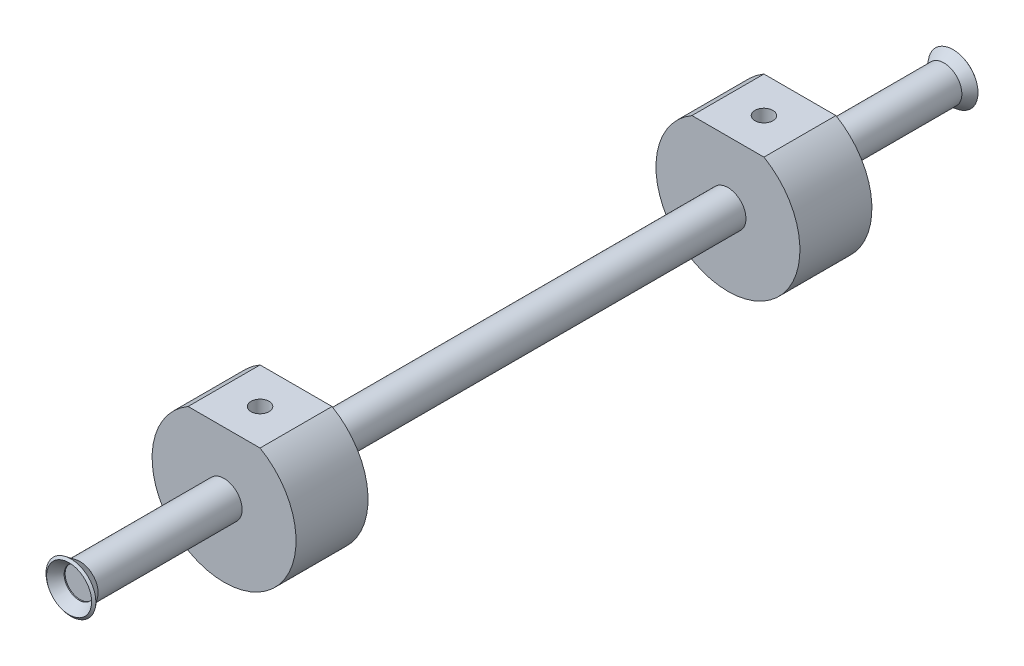
ISO-10303-21;
HEADER;
FILE_DESCRIPTION(('STEP AP214'),'2;1');
FILE_NAME('part.step','',(''),(''),'','','');
FILE_SCHEMA(('AUTOMOTIVE_DESIGN { 1 0 10303 214 1 1 1 1 }'));
ENDSEC;
DATA;
#1=APPLICATION_CONTEXT('core data for automotive mechanical design processes');
#2=APPLICATION_PROTOCOL_DEFINITION('international standard','automotive_design',2000,#1);
#3=PRODUCT_CONTEXT('',#1,'mechanical');
#4=PRODUCT('Part','Part','',(#3));
#5=PRODUCT_RELATED_PRODUCT_CATEGORY('part','',(#4));
#6=PRODUCT_DEFINITION_FORMATION('','',#4);
#7=PRODUCT_DEFINITION_CONTEXT('part definition',#1,'design');
#8=PRODUCT_DEFINITION('design','',#6,#7);
#9=PRODUCT_DEFINITION_SHAPE('','',#8);
#10=(LENGTH_UNIT() NAMED_UNIT(*) SI_UNIT(.MILLI.,.METRE.));
#11=(NAMED_UNIT(*) PLANE_ANGLE_UNIT() SI_UNIT($,.RADIAN.));
#12=(NAMED_UNIT(*) SI_UNIT($,.STERADIAN.) SOLID_ANGLE_UNIT());
#13=UNCERTAINTY_MEASURE_WITH_UNIT(LENGTH_MEASURE(1.E-05),#10,'distance_accuracy_value','');
#14=(GEOMETRIC_REPRESENTATION_CONTEXT(3) GLOBAL_UNCERTAINTY_ASSIGNED_CONTEXT((#13)) GLOBAL_UNIT_ASSIGNED_CONTEXT((#10,
#11,#12)) REPRESENTATION_CONTEXT('',''));
#15=CARTESIAN_POINT('',(0.,0.,0.));
#16=DIRECTION('',(0.,0.,1.));
#17=DIRECTION('',(1.,0.,0.));
#18=AXIS2_PLACEMENT_3D('',#15,#16,#17);
#19=CARTESIAN_POINT('',(0.,5.28320000000011,152.4));
#20=DIRECTION('',(0.,0.,1.));
#21=DIRECTION('',(0.,-1.,0.));
#22=AXIS2_PLACEMENT_3D('',#19,#20,#21);
#23=PLANE('',#22);
#24=CARTESIAN_POINT('',(0.,0.,152.4));
#25=DIRECTION('',(0.,0.,1.));
#26=DIRECTION('',(0.,-1.,0.));
#27=AXIS2_PLACEMENT_3D('',#24,#25,#26);
#28=CIRCLE('',#27,6.35);
#29=CARTESIAN_POINT('',(0.,-6.35000000000001,152.4));
#30=VERTEX_POINT('',#29);
#31=EDGE_CURVE('E70',#30,#30,#28,.T.);
#32=ORIENTED_EDGE('',*,*,#31,.F.);
#33=EDGE_LOOP('',(#32));
#34=FACE_BOUND('',#33,.T.);
#35=CARTESIAN_POINT('',(0.,0.,152.4));
#36=DIRECTION('',(0.,0.,1.));
#37=DIRECTION('',(0.,-1.,0.));
#38=AXIS2_PLACEMENT_3D('',#35,#36,#37);
#39=CIRCLE('',#38,5.2832);
#40=CARTESIAN_POINT('',(0.,-5.28320000000001,152.4));
#41=VERTEX_POINT('',#40);
#42=EDGE_CURVE('E12',#41,#41,#39,.T.);
#43=ORIENTED_EDGE('',*,*,#42,.T.);
#44=EDGE_LOOP('',(#43));
#45=FACE_BOUND('',#44,.T.);
#46=ADVANCED_FACE('F51',(#34,#45),#23,.F.);
#47=CARTESIAN_POINT('',(0.,0.,152.4));
#48=DIRECTION('',(0.,0.,1.));
#49=DIRECTION('',(0.,-1.,0.));
#50=AXIS2_PLACEMENT_3D('',#47,#48,#49);
#51=CYLINDRICAL_SURFACE('',#50,5.2832);
#52=ORIENTED_EDGE('',*,*,#42,.F.);
#53=EDGE_LOOP('',(#52));
#54=FACE_BOUND('',#53,.T.);
#55=CARTESIAN_POINT('',(0.,0.,152.756946286845));
#56=DIRECTION('',(0.,0.,1.));
#57=DIRECTION('',(0.,-1.,0.));
#58=AXIS2_PLACEMENT_3D('',#55,#56,#57);
#59=CIRCLE('',#58,5.2832);
#60=CARTESIAN_POINT('',(0.,-5.28320000000006,152.756946286845));
#61=VERTEX_POINT('',#60);
#62=EDGE_CURVE('E57',#61,#61,#59,.T.);
#63=ORIENTED_EDGE('',*,*,#62,.T.);
#64=EDGE_LOOP('',(#63));
#65=FACE_BOUND('',#64,.T.);
#66=ADVANCED_FACE('F77',(#54,#65),#51,.F.);
#67=CARTESIAN_POINT('',(0.,0.,156.287670979531));
#68=DIRECTION('',(0.,0.,1.));
#69=DIRECTION('',(0.,-1.,0.));
#70=AXIS2_PLACEMENT_3D('',#67,#68,#69);
#71=CONICAL_SURFACE('',#70,7.94379189197148,0.645771823237903);
#72=ORIENTED_EDGE('',*,*,#62,.F.);
#73=EDGE_LOOP('',(#72));
#74=FACE_BOUND('',#73,.T.);
#75=CARTESIAN_POINT('',(0.,0.,156.287670979531));
#76=DIRECTION('',(0.,0.,1.));
#77=DIRECTION('',(0.,-1.,0.));
#78=AXIS2_PLACEMENT_3D('',#75,#76,#77);
#79=CIRCLE('',#78,7.94379189197148);
#80=CARTESIAN_POINT('',(0.,-7.94379189197154,156.287670979531));
#81=VERTEX_POINT('',#80);
#82=EDGE_CURVE('E61',#81,#81,#79,.T.);
#83=ORIENTED_EDGE('',*,*,#82,.T.);
#84=EDGE_LOOP('',(#83));
#85=FACE_BOUND('',#84,.T.);
#86=ADVANCED_FACE('F81',(#74,#85),#71,.F.);
#87=CARTESIAN_POINT('',(0.,0.,155.645654712832));
#88=DIRECTION('',(0.,0.,-1.));
#89=DIRECTION('',(0.,1.,0.));
#90=AXIS2_PLACEMENT_3D('',#87,#88,#89);
#91=CONICAL_SURFACE('',#90,8.79577625408993,0.925024503556994);
#92=ORIENTED_EDGE('',*,*,#82,.F.);
#93=EDGE_LOOP('',(#92));
#94=FACE_BOUND('',#93,.T.);
#95=CARTESIAN_POINT('',(0.,0.,155.645654712832));
#96=DIRECTION('',(0.,0.,1.));
#97=DIRECTION('',(0.,-1.,0.));
#98=AXIS2_PLACEMENT_3D('',#95,#96,#97);
#99=CIRCLE('',#98,8.79577625408993);
#100=CARTESIAN_POINT('',(0.,-8.79577625409,155.645654712832));
#101=VERTEX_POINT('',#100);
#102=EDGE_CURVE('E65',#101,#101,#99,.T.);
#103=ORIENTED_EDGE('',*,*,#102,.T.);
#104=EDGE_LOOP('',(#103));
#105=FACE_BOUND('',#104,.T.);
#106=ADVANCED_FACE('F86',(#94,#105),#91,.T.);
#107=CARTESIAN_POINT('',(0.,0.,152.4));
#108=DIRECTION('',(0.,0.,1.));
#109=DIRECTION('',(0.,-1.,0.));
#110=AXIS2_PLACEMENT_3D('',#107,#108,#109);
#111=CONICAL_SURFACE('',#110,6.35,0.645771823237903);
#112=ORIENTED_EDGE('',*,*,#102,.F.);
#113=EDGE_LOOP('',(#112));
#114=FACE_BOUND('',#113,.T.);
#115=ORIENTED_EDGE('',*,*,#31,.T.);
#116=EDGE_LOOP('',(#115));
#117=FACE_BOUND('',#116,.T.);
#118=ADVANCED_FACE('F74',(#114,#117),#111,.T.);
#119=CLOSED_SHELL('',(#46,#66,#86,#106,#118));
#120=MANIFOLD_SOLID_BREP('B2',#119);
#121=CARTESIAN_POINT('',(0.,0.,152.4));
#122=DIRECTION('',(0.,0.,-1.));
#123=DIRECTION('',(-1.,0.,0.));
#124=AXIS2_PLACEMENT_3D('',#121,#122,#123);
#125=CYLINDRICAL_SURFACE('',#124,6.35);
#126=CARTESIAN_POINT('',(0.,0.,76.2));
#127=DIRECTION('',(0.,0.,1.));
#128=DIRECTION('',(1.,0.,0.));
#129=AXIS2_PLACEMENT_3D('',#126,#127,#128);
#130=CIRCLE('',#129,6.35);
#131=CARTESIAN_POINT('',(-6.35,0.,76.2));
#132=VERTEX_POINT('',#131);
#133=EDGE_CURVE('E220',#132,#132,#130,.T.);
#134=CARTESIAN_POINT('',(0.,0.,-76.2));
#135=DIRECTION('',(0.,0.,-1.));
#136=DIRECTION('',(-1.,0.,0.));
#137=AXIS2_PLACEMENT_3D('',#134,#135,#136);
#138=CIRCLE('',#137,6.35);
#139=CARTESIAN_POINT('',(-6.35,0.,-76.2));
#140=VERTEX_POINT('',#139);
#141=EDGE_CURVE('E140',#140,#140,#138,.T.);
#142=CARTESIAN_POINT('',(-6.35,0.,76.2));
#143=CARTESIAN_POINT('',(-6.35,0.,74.6125));
#144=CARTESIAN_POINT('',(-6.35,0.,73.025));
#145=CARTESIAN_POINT('',(-6.35,0.,69.85));
#146=CARTESIAN_POINT('',(-6.35,0.,68.2625));
#147=CARTESIAN_POINT('',(-6.35,0.,65.0875));
#148=CARTESIAN_POINT('',(-6.35,0.,63.5));
#149=CARTESIAN_POINT('',(-6.35,0.,60.325));
#150=CARTESIAN_POINT('',(-6.35,0.,58.7375));
#151=CARTESIAN_POINT('',(-6.35,0.,55.5625));
#152=CARTESIAN_POINT('',(-6.35,0.,53.975));
#153=CARTESIAN_POINT('',(-6.35,0.,50.8));
#154=CARTESIAN_POINT('',(-6.35,0.,49.2125));
#155=CARTESIAN_POINT('',(-6.35,0.,46.0375));
#156=CARTESIAN_POINT('',(-6.35,0.,44.45));
#157=CARTESIAN_POINT('',(-6.35,0.,41.275));
#158=CARTESIAN_POINT('',(-6.35,0.,39.6875));
#159=CARTESIAN_POINT('',(-6.35,0.,36.5125));
#160=CARTESIAN_POINT('',(-6.35,0.,34.925));
#161=CARTESIAN_POINT('',(-6.35,0.,31.75));
#162=CARTESIAN_POINT('',(-6.35,0.,30.1625));
#163=CARTESIAN_POINT('',(-6.35,0.,26.9875));
#164=CARTESIAN_POINT('',(-6.35,0.,25.4));
#165=CARTESIAN_POINT('',(-6.35,0.,22.225));
#166=CARTESIAN_POINT('',(-6.35,0.,20.6375));
#167=CARTESIAN_POINT('',(-6.35,0.,17.4625));
#168=CARTESIAN_POINT('',(-6.35,0.,15.875));
#169=CARTESIAN_POINT('',(-6.35,0.,12.7));
#170=CARTESIAN_POINT('',(-6.35,0.,11.1125));
#171=CARTESIAN_POINT('',(-6.35,0.,7.93750000000001));
#172=CARTESIAN_POINT('',(-6.35,0.,6.35));
#173=CARTESIAN_POINT('',(-6.35,0.,3.175));
#174=CARTESIAN_POINT('',(-6.35,0.,1.5875));
#175=CARTESIAN_POINT('',(-6.35,0.,-1.5875));
#176=CARTESIAN_POINT('',(-6.35,0.,-3.175));
#177=CARTESIAN_POINT('',(-6.35,0.,-6.35));
#178=CARTESIAN_POINT('',(-6.35,0.,-7.93750000000001));
#179=CARTESIAN_POINT('',(-6.35,0.,-11.1125));
#180=CARTESIAN_POINT('',(-6.35,0.,-12.7));
#181=CARTESIAN_POINT('',(-6.35,0.,-15.875));
#182=CARTESIAN_POINT('',(-6.35,0.,-17.4625));
#183=CARTESIAN_POINT('',(-6.35,0.,-20.6375));
#184=CARTESIAN_POINT('',(-6.35,0.,-22.225));
#185=CARTESIAN_POINT('',(-6.35,0.,-25.4));
#186=CARTESIAN_POINT('',(-6.35,0.,-26.9875));
#187=CARTESIAN_POINT('',(-6.35,0.,-30.1625));
#188=CARTESIAN_POINT('',(-6.35,0.,-31.75));
#189=CARTESIAN_POINT('',(-6.35,0.,-34.925));
#190=CARTESIAN_POINT('',(-6.35,0.,-36.5125));
#191=CARTESIAN_POINT('',(-6.35,0.,-39.6875));
#192=CARTESIAN_POINT('',(-6.35,0.,-41.275));
#193=CARTESIAN_POINT('',(-6.35,0.,-44.45));
#194=CARTESIAN_POINT('',(-6.35,0.,-46.0375));
#195=CARTESIAN_POINT('',(-6.35,0.,-49.2125));
#196=CARTESIAN_POINT('',(-6.35,0.,-50.8));
#197=CARTESIAN_POINT('',(-6.35,0.,-53.975));
#198=CARTESIAN_POINT('',(-6.35,0.,-55.5625));
#199=CARTESIAN_POINT('',(-6.35,0.,-58.7375));
#200=CARTESIAN_POINT('',(-6.35,0.,-60.325));
#201=CARTESIAN_POINT('',(-6.35,0.,-63.5));
#202=CARTESIAN_POINT('',(-6.35,0.,-65.0875));
#203=CARTESIAN_POINT('',(-6.35,0.,-68.2625));
#204=CARTESIAN_POINT('',(-6.35,0.,-69.85));
#205=CARTESIAN_POINT('',(-6.35,0.,-73.025));
#206=CARTESIAN_POINT('',(-6.35,0.,-74.6125));
#207=CARTESIAN_POINT('',(-6.35,0.,-76.2));
#208=B_SPLINE_CURVE_WITH_KNOTS('',3,(#142,#143,#144,#145,#146,#147,#148,#149,#150,#151,#152,
#153,#154,#155,#156,#157,#158,#159,#160,#161,#162,#163,#164,#165,#166,#167,#168,#169,#170,#171,
#172,#173,#174,#175,#176,#177,#178,#179,#180,#181,#182,#183,#184,#185,#186,#187,#188,#189,#190,
#191,#192,#193,#194,#195,#196,#197,#198,#199,#200,#201,#202,#203,#204,#205,#206,#207),
.UNSPECIFIED.,.F.,.F.,(4,2,2,2,2,2,2,2,2,2,2,2,2,2,2,2,2,2,2,2,2,2,2,2,2,2,2,2,2,2,2,2,4),(0.,
4.7625,9.52500000000001,14.2875,19.05,23.8125,28.575,33.3375,38.1,42.8625,47.625,52.3875,57.15,
61.9125,66.675,71.4375,76.2,80.9625,85.725,90.4875,95.25,100.0125,104.775,109.5375,114.3,
119.0625,123.825,128.5875,133.35,138.1125,142.875,147.6375,152.4),.UNSPECIFIED.);
#209=EDGE_CURVE('BSEAM131',#132,#140,#208,.T.);
#210=ORIENTED_EDGE('',*,*,#133,.F.);
#211=ORIENTED_EDGE('',*,*,#141,.F.);
#212=ORIENTED_EDGE('',*,*,#209,.T.);
#213=ORIENTED_EDGE('',*,*,#209,.F.);
#214=EDGE_LOOP('',(#210,#212,#211,#213));
#215=FACE_BOUND('',#214,.T.);
#216=ADVANCED_FACE('F131',(#215),#125,.T.);
#217=CARTESIAN_POINT('',(0.,0.,101.6));
#218=DIRECTION('',(0.,0.,1.));
#219=DIRECTION('',(1.,0.,0.));
#220=AXIS2_PLACEMENT_3D('',#217,#218,#219);
#221=CIRCLE('',#220,6.35);
#222=CARTESIAN_POINT('',(-6.35,0.,101.6));
#223=VERTEX_POINT('',#222);
#224=EDGE_CURVE('E216',#223,#223,#221,.T.);
#225=CARTESIAN_POINT('',(0.,0.,152.4));
#226=DIRECTION('',(0.,0.,1.));
#227=DIRECTION('',(1.,0.,0.));
#228=AXIS2_PLACEMENT_3D('',#225,#226,#227);
#229=CIRCLE('',#228,6.35);
#230=CARTESIAN_POINT('',(-6.35,0.,152.4));
#231=VERTEX_POINT('',#230);
#232=EDGE_CURVE('E217',#231,#231,#229,.T.);
#233=CARTESIAN_POINT('',(-6.35,0.,101.6));
#234=CARTESIAN_POINT('',(-6.35,0.,102.129166666667));
#235=CARTESIAN_POINT('',(-6.35,0.,102.658333333333));
#236=CARTESIAN_POINT('',(-6.35,0.,103.716666666667));
#237=CARTESIAN_POINT('',(-6.35,0.,104.245833333333));
#238=CARTESIAN_POINT('',(-6.35,0.,105.304166666667));
#239=CARTESIAN_POINT('',(-6.35,0.,105.833333333333));
#240=CARTESIAN_POINT('',(-6.35,0.,106.891666666667));
#241=CARTESIAN_POINT('',(-6.35,0.,107.420833333333));
#242=CARTESIAN_POINT('',(-6.35,0.,108.479166666667));
#243=CARTESIAN_POINT('',(-6.35,0.,109.008333333333));
#244=CARTESIAN_POINT('',(-6.35,0.,110.066666666667));
#245=CARTESIAN_POINT('',(-6.35,0.,110.595833333333));
#246=CARTESIAN_POINT('',(-6.35,0.,111.654166666667));
#247=CARTESIAN_POINT('',(-6.35,0.,112.183333333333));
#248=CARTESIAN_POINT('',(-6.35,0.,113.241666666667));
#249=CARTESIAN_POINT('',(-6.35,0.,113.770833333333));
#250=CARTESIAN_POINT('',(-6.35,0.,114.829166666667));
#251=CARTESIAN_POINT('',(-6.35,0.,115.358333333333));
#252=CARTESIAN_POINT('',(-6.35,0.,116.416666666667));
#253=CARTESIAN_POINT('',(-6.35,0.,116.945833333333));
#254=CARTESIAN_POINT('',(-6.35,0.,118.004166666667));
#255=CARTESIAN_POINT('',(-6.35,0.,118.533333333333));
#256=CARTESIAN_POINT('',(-6.35,0.,119.591666666667));
#257=CARTESIAN_POINT('',(-6.35,0.,120.120833333333));
#258=CARTESIAN_POINT('',(-6.35,0.,121.179166666667));
#259=CARTESIAN_POINT('',(-6.35,0.,121.708333333333));
#260=CARTESIAN_POINT('',(-6.35,0.,122.766666666667));
#261=CARTESIAN_POINT('',(-6.35,0.,123.295833333333));
#262=CARTESIAN_POINT('',(-6.35,0.,124.354166666667));
#263=CARTESIAN_POINT('',(-6.35,0.,124.883333333333));
#264=CARTESIAN_POINT('',(-6.35,0.,125.941666666667));
#265=CARTESIAN_POINT('',(-6.35,0.,126.470833333333));
#266=CARTESIAN_POINT('',(-6.35,0.,127.529166666667));
#267=CARTESIAN_POINT('',(-6.35,0.,128.058333333333));
#268=CARTESIAN_POINT('',(-6.35,0.,129.116666666667));
#269=CARTESIAN_POINT('',(-6.35,0.,129.645833333333));
#270=CARTESIAN_POINT('',(-6.35,0.,130.704166666667));
#271=CARTESIAN_POINT('',(-6.35,0.,131.233333333333));
#272=CARTESIAN_POINT('',(-6.35,0.,132.291666666667));
#273=CARTESIAN_POINT('',(-6.35,0.,132.820833333333));
#274=CARTESIAN_POINT('',(-6.35,0.,133.879166666667));
#275=CARTESIAN_POINT('',(-6.35,0.,134.408333333333));
#276=CARTESIAN_POINT('',(-6.35,0.,135.466666666667));
#277=CARTESIAN_POINT('',(-6.35,0.,135.995833333333));
#278=CARTESIAN_POINT('',(-6.35,0.,137.054166666667));
#279=CARTESIAN_POINT('',(-6.35,0.,137.583333333333));
#280=CARTESIAN_POINT('',(-6.35,0.,138.641666666667));
#281=CARTESIAN_POINT('',(-6.35,0.,139.170833333333));
#282=CARTESIAN_POINT('',(-6.35,0.,140.229166666667));
#283=CARTESIAN_POINT('',(-6.35,0.,140.758333333333));
#284=CARTESIAN_POINT('',(-6.35,0.,141.816666666667));
#285=CARTESIAN_POINT('',(-6.35,0.,142.345833333333));
#286=CARTESIAN_POINT('',(-6.35,0.,143.404166666667));
#287=CARTESIAN_POINT('',(-6.35,0.,143.933333333333));
#288=CARTESIAN_POINT('',(-6.35,0.,144.991666666667));
#289=CARTESIAN_POINT('',(-6.35,0.,145.520833333333));
#290=CARTESIAN_POINT('',(-6.35,0.,146.579166666667));
#291=CARTESIAN_POINT('',(-6.35,0.,147.108333333333));
#292=CARTESIAN_POINT('',(-6.35,0.,148.166666666667));
#293=CARTESIAN_POINT('',(-6.35,0.,148.695833333333));
#294=CARTESIAN_POINT('',(-6.35,0.,149.754166666667));
#295=CARTESIAN_POINT('',(-6.35,0.,150.283333333333));
#296=CARTESIAN_POINT('',(-6.35,0.,151.341666666667));
#297=CARTESIAN_POINT('',(-6.35,0.,151.870833333333));
#298=CARTESIAN_POINT('',(-6.35,0.,152.4));
#299=B_SPLINE_CURVE_WITH_KNOTS('',3,(#233,#234,#235,#236,#237,#238,#239,#240,#241,#242,#243,
#244,#245,#246,#247,#248,#249,#250,#251,#252,#253,#254,#255,#256,#257,#258,#259,#260,#261,#262,
#263,#264,#265,#266,#267,#268,#269,#270,#271,#272,#273,#274,#275,#276,#277,#278,#279,#280,#281,
#282,#283,#284,#285,#286,#287,#288,#289,#290,#291,#292,#293,#294,#295,#296,#297,#298),
.UNSPECIFIED.,.F.,.F.,(4,2,2,2,2,2,2,2,2,2,2,2,2,2,2,2,2,2,2,2,2,2,2,2,2,2,2,2,2,2,2,2,4),(0.,
1.58749999999999,3.17499999999998,4.7625,6.34999999999999,7.93749999999999,9.52500000000001,
11.1125,12.7,14.2875,15.875,17.4625,19.05,20.6375,22.225,23.8125,25.4,26.9875,28.575,30.1625,
31.75,33.3375,34.925,36.5125,38.1,39.6875,41.275,42.8625,44.45,46.0375,47.625,49.2125,50.8),.UNSPECIFIED.);
#300=EDGE_CURVE('BSEAM233',#223,#231,#299,.T.);
#301=ORIENTED_EDGE('',*,*,#224,.T.);
#302=ORIENTED_EDGE('',*,*,#232,.F.);
#303=ORIENTED_EDGE('',*,*,#300,.T.);
#304=ORIENTED_EDGE('',*,*,#300,.F.);
#305=EDGE_LOOP('',(#301,#303,#302,#304));
#306=FACE_BOUND('',#305,.T.);
#307=ADVANCED_FACE('F233',(#306),#125,.T.);
#308=CARTESIAN_POINT('',(0.,0.,152.4));
#309=DIRECTION('',(0.,0.,1.));
#310=DIRECTION('',(1.,0.,0.));
#311=AXIS2_PLACEMENT_3D('',#308,#309,#310);
#312=PLANE('',#311);
#313=ORIENTED_EDGE('',*,*,#232,.T.);
#314=EDGE_LOOP('',(#313));
#315=FACE_BOUND('',#314,.T.);
#316=ADVANCED_FACE('F133',(#315),#312,.T.);
#317=CARTESIAN_POINT('',(0.,0.,101.6));
#318=DIRECTION('',(0.,0.,-1.));
#319=DIRECTION('',(-1.,0.,0.));
#320=AXIS2_PLACEMENT_3D('',#317,#318,#319);
#321=CYLINDRICAL_SURFACE('',#320,25.4);
#322=CARTESIAN_POINT('',(0.,0.,76.2));
#323=DIRECTION('',(0.,0.,1.));
#324=DIRECTION('',(1.,0.,0.));
#325=AXIS2_PLACEMENT_3D('',#322,#323,#324);
#326=CIRCLE('',#325,25.4);
#327=CARTESIAN_POINT('',(-12.7,21.9970452561247,76.2));
#328=VERTEX_POINT('',#327);
#329=CARTESIAN_POINT('',(12.7,21.9970452561247,76.2));
#330=VERTEX_POINT('',#329);
#331=EDGE_CURVE('E201',#328,#330,#326,.T.);
#332=ORIENTED_EDGE('',*,*,#331,.T.);
#333=DIRECTION('',(0.,0.,-1.));
#334=VECTOR('',#333,1.);
#335=CARTESIAN_POINT('',(12.7,21.9970452561247,101.6));
#336=LINE('',#335,#334);
#337=CARTESIAN_POINT('',(12.7,21.9970452561247,101.6));
#338=VERTEX_POINT('',#337);
#339=EDGE_CURVE('E214',#338,#330,#336,.T.);
#340=ORIENTED_EDGE('',*,*,#339,.F.);
#341=CARTESIAN_POINT('',(0.,0.,101.6));
#342=DIRECTION('',(0.,0.,1.));
#343=DIRECTION('',(1.,0.,0.));
#344=AXIS2_PLACEMENT_3D('',#341,#342,#343);
#345=CIRCLE('',#344,25.4);
#346=CARTESIAN_POINT('',(-12.7,21.9970452561247,101.6));
#347=VERTEX_POINT('',#346);
#348=EDGE_CURVE('E205',#347,#338,#345,.T.);
#349=ORIENTED_EDGE('',*,*,#348,.F.);
#350=DIRECTION('',(0.,0.,-1.));
#351=VECTOR('',#350,1.);
#352=CARTESIAN_POINT('',(-12.7,21.9970452561247,101.6));
#353=LINE('',#352,#351);
#354=EDGE_CURVE('E208',#347,#328,#353,.T.);
#355=ORIENTED_EDGE('',*,*,#354,.T.);
#356=EDGE_LOOP('',(#332,#340,#349,#355));
#357=FACE_BOUND('',#356,.T.);
#358=ADVANCED_FACE('F275',(#357),#321,.T.);
#359=CARTESIAN_POINT('',(-12.7,21.9970452561247,101.6));
#360=DIRECTION('',(0.,-1.,0.));
#361=DIRECTION('',(0.,0.,-1.));
#362=AXIS2_PLACEMENT_3D('',#359,#360,#361);
#363=PLANE('',#362);
#364=CARTESIAN_POINT('',(0.,21.9970452561247,88.9));
#365=DIRECTION('',(0.,1.,0.));
#366=DIRECTION('',(0.,0.,1.));
#367=AXIS2_PLACEMENT_3D('',#364,#365,#366);
#368=CIRCLE('',#367,3.175);
#369=CARTESIAN_POINT('',(0.,21.9970452561247,92.075));
#370=VERTEX_POINT('',#369);
#371=EDGE_CURVE('E202',#370,#370,#368,.T.);
#372=ORIENTED_EDGE('',*,*,#371,.F.);
#373=EDGE_LOOP('',(#372));
#374=FACE_BOUND('',#373,.T.);
#375=DIRECTION('',(-1.,0.,0.));
#376=VECTOR('',#375,1.);
#377=CARTESIAN_POINT('',(-12.7,21.9970452561247,76.2));
#378=LINE('',#377,#376);
#379=EDGE_CURVE('E157',#330,#328,#378,.T.);
#380=ORIENTED_EDGE('',*,*,#379,.T.);
#381=ORIENTED_EDGE('',*,*,#354,.F.);
#382=DIRECTION('',(-1.,0.,0.));
#383=VECTOR('',#382,1.);
#384=CARTESIAN_POINT('',(-12.7,21.9970452561247,101.6));
#385=LINE('',#384,#383);
#386=EDGE_CURVE('E147',#338,#347,#385,.T.);
#387=ORIENTED_EDGE('',*,*,#386,.F.);
#388=ORIENTED_EDGE('',*,*,#339,.T.);
#389=EDGE_LOOP('',(#380,#381,#387,#388));
#390=FACE_BOUND('',#389,.T.);
#391=ADVANCED_FACE('F269',(#374,#390),#363,.F.);
#392=CARTESIAN_POINT('',(0.,0.,101.6));
#393=DIRECTION('',(0.,0.,1.));
#394=DIRECTION('',(1.,0.,0.));
#395=AXIS2_PLACEMENT_3D('',#392,#393,#394);
#396=PLANE('',#395);
#397=ORIENTED_EDGE('',*,*,#224,.F.);
#398=EDGE_LOOP('',(#397));
#399=FACE_BOUND('',#398,.T.);
#400=ORIENTED_EDGE('',*,*,#348,.T.);
#401=ORIENTED_EDGE('',*,*,#386,.T.);
#402=EDGE_LOOP('',(#400,#401));
#403=FACE_BOUND('',#402,.T.);
#404=ADVANCED_FACE('F266',(#399,#403),#396,.T.);
#405=CARTESIAN_POINT('',(0.,0.,76.2));
#406=DIRECTION('',(0.,0.,1.));
#407=DIRECTION('',(1.,0.,0.));
#408=AXIS2_PLACEMENT_3D('',#405,#406,#407);
#409=PLANE('',#408);
#410=ORIENTED_EDGE('',*,*,#133,.T.);
#411=EDGE_LOOP('',(#410));
#412=FACE_BOUND('',#411,.T.);
#413=ORIENTED_EDGE('',*,*,#331,.F.);
#414=ORIENTED_EDGE('',*,*,#379,.F.);
#415=EDGE_LOOP('',(#413,#414));
#416=FACE_BOUND('',#415,.T.);
#417=ADVANCED_FACE('F264',(#412,#416),#409,.F.);
#418=CARTESIAN_POINT('',(0.,2.94704525612474,88.9));
#419=DIRECTION('',(0.,1.,0.));
#420=DIRECTION('',(0.,0.,1.));
#421=AXIS2_PLACEMENT_3D('',#418,#419,#420);
#422=CYLINDRICAL_SURFACE('',#421,3.175);
#423=CARTESIAN_POINT('',(0.,2.94704525612474,88.9));
#424=DIRECTION('',(0.,1.,0.));
#425=DIRECTION('',(0.,0.,1.));
#426=AXIS2_PLACEMENT_3D('',#423,#424,#425);
#427=CIRCLE('',#426,3.175);
#428=CARTESIAN_POINT('',(0.,2.94704525612474,92.075));
#429=VERTEX_POINT('',#428);
#430=EDGE_CURVE('E198',#429,#429,#427,.T.);
#431=CARTESIAN_POINT('',(0.,2.94704525612474,92.075));
#432=CARTESIAN_POINT('',(0.,3.14548275612474,92.075));
#433=CARTESIAN_POINT('',(0.,3.34392025612474,92.075));
#434=CARTESIAN_POINT('',(0.,3.74079525612474,92.075));
#435=CARTESIAN_POINT('',(0.,3.93923275612474,92.075));
#436=CARTESIAN_POINT('',(0.,4.33610775612474,92.075));
#437=CARTESIAN_POINT('',(0.,4.53454525612474,92.075));
#438=CARTESIAN_POINT('',(0.,4.93142025612474,92.075));
#439=CARTESIAN_POINT('',(0.,5.12985775612474,92.075));
#440=CARTESIAN_POINT('',(0.,5.52673275612474,92.075));
#441=CARTESIAN_POINT('',(0.,5.72517025612474,92.075));
#442=CARTESIAN_POINT('',(0.,6.12204525612474,92.075));
#443=CARTESIAN_POINT('',(0.,6.32048275612474,92.075));
#444=CARTESIAN_POINT('',(0.,6.71735775612474,92.075));
#445=CARTESIAN_POINT('',(0.,6.91579525612474,92.075));
#446=CARTESIAN_POINT('',(0.,7.31267025612474,92.075));
#447=CARTESIAN_POINT('',(0.,7.51110775612474,92.075));
#448=CARTESIAN_POINT('',(0.,7.90798275612474,92.075));
#449=CARTESIAN_POINT('',(0.,8.10642025612474,92.075));
#450=CARTESIAN_POINT('',(0.,8.50329525612474,92.075));
#451=CARTESIAN_POINT('',(0.,8.70173275612474,92.075));
#452=CARTESIAN_POINT('',(0.,9.09860775612474,92.075));
#453=CARTESIAN_POINT('',(0.,9.29704525612474,92.075));
#454=CARTESIAN_POINT('',(0.,9.69392025612474,92.075));
#455=CARTESIAN_POINT('',(0.,9.89235775612474,92.075));
#456=CARTESIAN_POINT('',(0.,10.2892327561247,92.075));
#457=CARTESIAN_POINT('',(0.,10.4876702561247,92.075));
#458=CARTESIAN_POINT('',(0.,10.8845452561247,92.075));
#459=CARTESIAN_POINT('',(0.,11.0829827561247,92.075));
#460=CARTESIAN_POINT('',(0.,11.4798577561247,92.075));
#461=CARTESIAN_POINT('',(0.,11.6782952561247,92.075));
#462=CARTESIAN_POINT('',(0.,12.0751702561247,92.075));
#463=CARTESIAN_POINT('',(0.,12.2736077561247,92.075));
#464=CARTESIAN_POINT('',(0.,12.6704827561247,92.075));
#465=CARTESIAN_POINT('',(0.,12.8689202561247,92.075));
#466=CARTESIAN_POINT('',(0.,13.2657952561247,92.075));
#467=CARTESIAN_POINT('',(0.,13.4642327561247,92.075));
#468=CARTESIAN_POINT('',(0.,13.8611077561247,92.075));
#469=CARTESIAN_POINT('',(0.,14.0595452561247,92.075));
#470=CARTESIAN_POINT('',(0.,14.4564202561247,92.075));
#471=CARTESIAN_POINT('',(0.,14.6548577561247,92.075));
#472=CARTESIAN_POINT('',(0.,15.0517327561247,92.075));
#473=CARTESIAN_POINT('',(0.,15.2501702561247,92.075));
#474=CARTESIAN_POINT('',(0.,15.6470452561247,92.075));
#475=CARTESIAN_POINT('',(0.,15.8454827561247,92.075));
#476=CARTESIAN_POINT('',(0.,16.2423577561247,92.075));
#477=CARTESIAN_POINT('',(0.,16.4407952561247,92.075));
#478=CARTESIAN_POINT('',(0.,16.8376702561247,92.075));
#479=CARTESIAN_POINT('',(0.,17.0361077561247,92.075));
#480=CARTESIAN_POINT('',(0.,17.4329827561247,92.075));
#481=CARTESIAN_POINT('',(0.,17.6314202561247,92.075));
#482=CARTESIAN_POINT('',(0.,18.0282952561247,92.075));
#483=CARTESIAN_POINT('',(0.,18.2267327561247,92.075));
#484=CARTESIAN_POINT('',(0.,18.6236077561247,92.075));
#485=CARTESIAN_POINT('',(0.,18.8220452561247,92.075));
#486=CARTESIAN_POINT('',(0.,19.2189202561247,92.075));
#487=CARTESIAN_POINT('',(0.,19.4173577561247,92.075));
#488=CARTESIAN_POINT('',(0.,19.8142327561247,92.075));
#489=CARTESIAN_POINT('',(0.,20.0126702561247,92.075));
#490=CARTESIAN_POINT('',(0.,20.4095452561247,92.075));
#491=CARTESIAN_POINT('',(0.,20.6079827561247,92.075));
#492=CARTESIAN_POINT('',(0.,21.0048577561247,92.075));
#493=CARTESIAN_POINT('',(0.,21.2032952561247,92.075));
#494=CARTESIAN_POINT('',(0.,21.6001702561247,92.075));
#495=CARTESIAN_POINT('',(0.,21.7986077561247,92.075));
#496=CARTESIAN_POINT('',(0.,21.9970452561247,92.075));
#497=B_SPLINE_CURVE_WITH_KNOTS('',3,(#431,#432,#433,#434,#435,#436,#437,#438,#439,#440,#441,
#442,#443,#444,#445,#446,#447,#448,#449,#450,#451,#452,#453,#454,#455,#456,#457,#458,#459,#460,
#461,#462,#463,#464,#465,#466,#467,#468,#469,#470,#471,#472,#473,#474,#475,#476,#477,#478,#479,
#480,#481,#482,#483,#484,#485,#486,#487,#488,#489,#490,#491,#492,#493,#494,#495,#496),
.UNSPECIFIED.,.F.,.F.,(4,2,2,2,2,2,2,2,2,2,2,2,2,2,2,2,2,2,2,2,2,2,2,2,2,2,2,2,2,2,2,2,4),(0.,
0.5953125,1.190625,1.7859375,2.38125,2.9765625,3.571875,4.1671875,4.7625,5.3578125,5.953125,
6.5484375,7.14375,7.7390625,8.334375,8.9296875,9.525,10.1203125,10.715625,11.3109375,11.90625,
12.5015625,13.096875,13.6921875,14.2875,14.8828125,15.478125,16.0734375,16.66875,17.2640625,
17.859375,18.4546875,19.05),.UNSPECIFIED.);
#498=EDGE_CURVE('BSEAM260',#429,#370,#497,.T.);
#499=ORIENTED_EDGE('',*,*,#430,.F.);
#500=ORIENTED_EDGE('',*,*,#371,.T.);
#501=ORIENTED_EDGE('',*,*,#498,.T.);
#502=ORIENTED_EDGE('',*,*,#498,.F.);
#503=EDGE_LOOP('',(#499,#501,#500,#502));
#504=FACE_BOUND('',#503,.T.);
#505=ADVANCED_FACE('F260',(#504),#422,.F.);
#506=CARTESIAN_POINT('',(0.,2.94704525612474,88.9));
#507=DIRECTION('',(0.,1.,0.));
#508=DIRECTION('',(0.,0.,1.));
#509=AXIS2_PLACEMENT_3D('',#506,#507,#508);
#510=PLANE('',#509);
#511=ORIENTED_EDGE('',*,*,#430,.T.);
#512=EDGE_LOOP('',(#511));
#513=FACE_BOUND('',#512,.T.);
#514=ADVANCED_FACE('F242',(#513),#510,.T.);
#515=CARTESIAN_POINT('',(0.,2.94704525612474,-88.9));
#516=DIRECTION('',(0.,1.,0.));
#517=DIRECTION('',(0.,0.,-1.));
#518=AXIS2_PLACEMENT_3D('',#515,#516,#517);
#519=CYLINDRICAL_SURFACE('',#518,3.175);
#520=CARTESIAN_POINT('',(0.,21.9970452561247,-88.9));
#521=DIRECTION('',(0.,-1.,0.));
#522=DIRECTION('',(0.,0.,-1.));
#523=AXIS2_PLACEMENT_3D('',#520,#521,#522);
#524=CIRCLE('',#523,3.175);
#525=CARTESIAN_POINT('',(0.,21.9970452561247,-92.075));
#526=VERTEX_POINT('',#525);
#527=EDGE_CURVE('E179',#526,#526,#524,.T.);
#528=ORIENTED_EDGE('',*,*,#527,.F.);
#529=EDGE_LOOP('',(#528));
#530=FACE_BOUND('',#529,.T.);
#531=CARTESIAN_POINT('',(0.,6.35,-92.075));
#532=CARTESIAN_POINT('',(0.0834969220594998,6.34999931166444,-92.0749991122824));
#533=CARTESIAN_POINT('',(0.167002655580042,6.34834758911701,-92.0717001255541));
#534=CARTESIAN_POINT('',(0.333378330258782,6.34179105821714,-92.0585541254501));
#535=CARTESIAN_POINT('',(0.416247978955773,6.33688483467113,-92.0487042634742));
#536=CARTESIAN_POINT('',(0.663182030647012,6.31742426748325,-92.009427934954));
#537=CARTESIAN_POINT('',(0.825450146761557,6.29812827299425,-91.9702749225986));
#538=CARTESIAN_POINT('',(1.13965128900426,6.2489182313574,-91.8680092887059));
#539=CARTESIAN_POINT('',(1.29162180811869,6.21904547786825,-91.8049897807566));
#540=CARTESIAN_POINT('',(1.58264035037879,6.15142812041637,-91.6572639263711));
#541=CARTESIAN_POINT('',(1.72168939123018,6.11368413715877,-91.572559289849));
#542=CARTESIAN_POINT('',(1.99234108848172,6.03111096182982,-91.3780303702658));
#543=CARTESIAN_POINT('',(2.12298433900092,5.98599127270818,-91.2669964222061));
#544=CARTESIAN_POINT('',(2.36467069069854,5.89470535591056,-91.0256033164272));
#545=CARTESIAN_POINT('',(2.47569885601321,5.84853836069043,-90.8952295702336));
#546=CARTESIAN_POINT('',(2.68368848497886,5.75623634934464,-90.6065790522467));
#547=CARTESIAN_POINT('',(2.77889135161933,5.71038146176788,-90.4469224686984));
#548=CARTESIAN_POINT('',(2.90019349951534,5.64919759286363,-90.1954520128256));
#549=CARTESIAN_POINT('',(2.93705266116891,5.63006420805933,-90.1095999381713));
#550=CARTESIAN_POINT('',(3.00322508739606,5.59504604853267,-89.9344143862936));
#551=CARTESIAN_POINT('',(3.03254280972159,5.57915935583429,-89.8450830018194));
#552=CARTESIAN_POINT('',(3.08174263292982,5.55212611635049,-89.6689894480352));
#553=CARTESIAN_POINT('',(3.10208128111978,5.54075429137746,-89.5823892059714));
#554=CARTESIAN_POINT('',(3.13545600360765,5.52193654886444,-89.4074127210056));
#555=CARTESIAN_POINT('',(3.14849595237257,5.51448854851135,-89.3190374462283));
#556=CARTESIAN_POINT('',(3.1670771305344,5.50383875782919,-89.1412932611514));
#557=CARTESIAN_POINT('',(3.17262287599649,5.50063441026522,-89.0519249820126));
#558=CARTESIAN_POINT('',(3.17614778806993,5.49859788398609,-88.8730192158219));
#559=CARTESIAN_POINT('',(3.17412767659871,5.49976528812799,-88.7834817457287));
#560=CARTESIAN_POINT('',(3.1581193033026,5.50899190362733,-88.5372521242756));
#561=CARTESIAN_POINT('',(3.13621253452965,5.52160857357707,-88.3811582701867));
#562=CARTESIAN_POINT('',(3.07003746372168,5.55866493052824,-88.0753533586935));
#563=CARTESIAN_POINT('',(3.02576203854505,5.58310838358077,-87.9256443509773));
#564=CARTESIAN_POINT('',(2.91531509833647,5.64157885407237,-87.6324557034359));
#565=CARTESIAN_POINT('',(2.84865758129418,5.67581583876129,-87.4892023900634));
#566=CARTESIAN_POINT('',(2.69570761526054,5.75003268807633,-87.215233913826));
#567=CARTESIAN_POINT('',(2.60940634674629,5.79001512927803,-87.0845244203915));
#568=CARTESIAN_POINT('',(2.40685964249566,5.87734289018611,-86.8218957257497));
#569=CARTESIAN_POINT('',(2.28820488335253,5.92497898403936,-86.6919246151435));
#570=CARTESIAN_POINT('',(2.03058898448427,6.01813700574905,-86.4529148571362));
#571=CARTESIAN_POINT('',(1.89161819563546,6.06365791538158,-86.3438862136413));
#572=CARTESIAN_POINT('',(1.58913989972482,6.1500381059768,-86.1450980802803));
#573=CARTESIAN_POINT('',(1.42479265164788,6.19058274974572,-86.0564685144201));
#574=CARTESIAN_POINT('',(1.08098023585582,6.25976272299952,-85.9088419183647));
#575=CARTESIAN_POINT('',(0.901527205073887,6.28840750578946,-85.8498213588683));
#576=CARTESIAN_POINT('',(0.548533610626826,6.32854759690358,-85.767940596601));
#577=CARTESIAN_POINT('',(0.375734359385238,6.34126679122995,-85.7424903274127));
#578=CARTESIAN_POINT('',(0.0278752299448269,6.35231817716325,-85.7203494777397));
#579=CARTESIAN_POINT('',(-0.147183538060024,6.35065718436129,-85.7236452728607));
#580=CARTESIAN_POINT('',(-0.480164686080366,6.33384535408399,-85.7574062359454));
#581=CARTESIAN_POINT('',(-0.638363620564192,6.31975005060431,-85.7857457914749));
#582=CARTESIAN_POINT('',(-0.947441883053001,6.28085393924121,-85.8654558782099));
#583=CARTESIAN_POINT('',(-1.09832040207141,6.25605195113515,-85.9168289484773));
#584=CARTESIAN_POINT('',(-1.39347133182512,6.19709998236334,-86.0424951309378));
#585=CARTESIAN_POINT('',(-1.53743151047822,6.16270299610718,-86.1174015841112));
#586=CARTESIAN_POINT('',(-1.8112148234104,6.08787118465664,-86.2873164256859));
#587=CARTESIAN_POINT('',(-1.94103189959927,6.0474337895468,-86.3823333773854));
#588=CARTESIAN_POINT('',(-2.19636241342679,5.95973602709939,-86.6005393503738));
#589=CARTESIAN_POINT('',(-2.32020134681979,5.91219559251098,-86.7255786071116));
#590=CARTESIAN_POINT('',(-2.54589381918873,5.81858093231368,-86.9947623551498));
#591=CARTESIAN_POINT('',(-2.6477321493525,5.77250773963547,-87.1389199523809));
#592=CARTESIAN_POINT('',(-2.83117262876716,5.68487535288742,-87.4510686019584));
#593=CARTESIAN_POINT('',(-2.91155594998014,5.64364281441821,-87.6198757695104));
#594=CARTESIAN_POINT('',(-3.04191297152938,5.5744767953732,-87.9713444648897));
#595=CARTESIAN_POINT('',(-3.09192585492219,5.54652618900869,-88.1539877978474));
#596=CARTESIAN_POINT('',(-3.15551086037917,5.51057765714603,-88.5091899564702));
#597=CARTESIAN_POINT('',(-3.17212027309711,5.50092192343245,-88.6810337504072));
#598=CARTESIAN_POINT('',(-3.17718805563876,5.49800001145358,-89.0252444424952));
#599=CARTESIAN_POINT('',(-3.16565862768385,5.50472672904441,-89.1976110815427));
#600=CARTESIAN_POINT('',(-3.11761548073657,5.53205211477784,-89.5206601030739));
#601=CARTESIAN_POINT('',(-3.08358651207686,5.5512682307627,-89.6718439417312));
#602=CARTESIAN_POINT('',(-2.99458164828807,5.59977978302582,-89.9661908301672));
#603=CARTESIAN_POINT('',(-2.93959901505999,5.62907846127335,-90.1093512828503));
#604=CARTESIAN_POINT('',(-2.8061154442137,5.69685576337174,-90.3942336994286));
#605=CARTESIAN_POINT('',(-2.72628260503929,5.73581889480533,-90.5352128093657));
#606=CARTESIAN_POINT('',(-2.54682759156583,5.81772207082382,-90.8026974317231));
#607=CARTESIAN_POINT('',(-2.44719512169931,5.8606641782013,-90.9291953599427));
#608=CARTESIAN_POINT('',(-2.21680287661219,5.95192753761204,-91.1800975241771));
#609=CARTESIAN_POINT('',(-2.08373188558712,6.00026839877346,-91.3023797564128));
#610=CARTESIAN_POINT('',(-1.79751265125244,6.0921234557675,-91.5233978732331));
#611=CARTESIAN_POINT('',(-1.64435365457428,6.13563504323043,-91.6221210659827));
#612=CARTESIAN_POINT('',(-1.40178715704488,6.19391073190242,-91.7502802661971));
#613=CARTESIAN_POINT('',(-1.31842200030919,6.21223173271383,-91.7898005836814));
#614=CARTESIAN_POINT('',(-1.14807701021671,6.24595363475603,-91.8615994748237));
#615=CARTESIAN_POINT('',(-1.06109897786307,6.26135597012704,-91.8938816065344));
#616=CARTESIAN_POINT('',(-0.884361322813114,6.28875097111981,-91.950759345915));
#617=CARTESIAN_POINT('',(-0.794608244970577,6.30075106809478,-91.9753717181381));
#618=CARTESIAN_POINT('',(-0.612925661591586,6.32100983571903,-92.0166673895299));
#619=CARTESIAN_POINT('',(-0.520997521680293,6.3292707916836,-92.0333555321936));
#620=CARTESIAN_POINT('',(-0.357531347524377,6.34032503263334,-92.0556162848624));
#621=CARTESIAN_POINT('',(-0.286274046488597,6.34394670812889,-92.0628788212496));
#622=CARTESIAN_POINT('',(-0.143346668941347,6.34878452045567,-92.0725711265376));
#623=CARTESIAN_POINT('',(-0.0716765810914261,6.35000059089052,-92.0750007620468));
#624=CARTESIAN_POINT('',(0.,6.35,-92.075));
#625=B_SPLINE_CURVE_WITH_KNOTS('',3,(#531,#532,#533,#534,#535,#536,#537,#538,#539,#540,#541,
#542,#543,#544,#545,#546,#547,#548,#549,#550,#551,#552,#553,#554,#555,#556,#557,#558,#559,#560,
#561,#562,#563,#564,#565,#566,#567,#568,#569,#570,#571,#572,#573,#574,#575,#576,#577,#578,#579,
#580,#581,#582,#583,#584,#585,#586,#587,#588,#589,#590,#591,#592,#593,#594,#595,#596,#597,#598,
#599,#600,#601,#602,#603,#604,#605,#606,#607,#608,#609,#610,#611,#612,#613,#614,#615,#616,#617,
#618,#619,#620,#621,#622,#623,#624),.UNSPECIFIED.,.T.,.F.,(4,2,2,2,2,2,2,2,2,2,2,2,2,2,2,2,2,2,
2,2,2,2,2,2,2,2,2,2,2,2,2,2,2,2,2,2,2,2,2,2,2,2,2,2,2,2,4),(0.,0.25041561210268,
0.500940186864016,1.00234854488129,1.50182051324264,2.00125310940106,2.53090025348453,
3.06094897410616,3.63210298373098,3.91787290005988,4.2034735073285,4.47213270490105,
4.74064915090149,5.00900371453887,5.27733267302574,5.74927594687736,6.22136960256845,
6.70445970327762,7.18776712794019,7.7323564652788,8.27720530143646,8.84735553323666,
9.41705196489304,9.93956405039339,10.4618285011675,10.9436138594975,11.4254523397102,
11.9210677568139,12.4168946391879,12.9614122158798,13.5063050164601,14.0775857365549,
14.6481278321882,15.1639000911419,15.6794487286237,16.1458838633213,16.6124691169503,
17.1104020806943,17.6085946442304,18.1673210354482,18.7263477502426,19.0082017078365,
19.2899168101042,19.5710117490933,19.8519346536844,20.0668939492147,20.2818591776892),.UNSPECIFIED.);
#626=CARTESIAN_POINT('',(0.,6.35,-92.075));
#627=VERTEX_POINT('',#626);
#628=EDGE_CURVE('E223',#627,#627,#625,.T.);
#629=ORIENTED_EDGE('',*,*,#628,.T.);
#630=EDGE_LOOP('',(#629));
#631=FACE_BOUND('',#630,.T.);
#632=ADVANCED_FACE('F236',(#530,#631),#519,.F.);
#633=CARTESIAN_POINT('',(0.,0.,-101.6));
#634=DIRECTION('',(0.,0.,-1.));
#635=DIRECTION('',(1.,0.,0.));
#636=AXIS2_PLACEMENT_3D('',#633,#634,#635);
#637=PLANE('',#636);
#638=CARTESIAN_POINT('',(0.,0.,-101.6));
#639=DIRECTION('',(0.,0.,-1.));
#640=DIRECTION('',(-1.,0.,0.));
#641=AXIS2_PLACEMENT_3D('',#638,#639,#640);
#642=CIRCLE('',#641,6.35);
#643=CARTESIAN_POINT('',(-6.35,0.,-101.6));
#644=VERTEX_POINT('',#643);
#645=EDGE_CURVE('E193',#644,#644,#642,.T.);
#646=ORIENTED_EDGE('',*,*,#645,.F.);
#647=EDGE_LOOP('',(#646));
#648=FACE_BOUND('',#647,.T.);
#649=CARTESIAN_POINT('',(0.,0.,-101.6));
#650=DIRECTION('',(0.,0.,1.));
#651=DIRECTION('',(1.,0.,0.));
#652=AXIS2_PLACEMENT_3D('',#649,#650,#651);
#653=CIRCLE('',#652,25.4);
#654=CARTESIAN_POINT('',(-12.7,21.9970452561247,-101.6));
#655=VERTEX_POINT('',#654);
#656=CARTESIAN_POINT('',(12.7,21.9970452561247,-101.6));
#657=VERTEX_POINT('',#656);
#658=EDGE_CURVE('E191',#655,#657,#653,.T.);
#659=ORIENTED_EDGE('',*,*,#658,.F.);
#660=DIRECTION('',(-1.,0.,0.));
#661=VECTOR('',#660,1.);
#662=CARTESIAN_POINT('',(-12.7,21.9970452561247,-101.6));
#663=LINE('',#662,#661);
#664=EDGE_CURVE('E184',#657,#655,#663,.T.);
#665=ORIENTED_EDGE('',*,*,#664,.F.);
#666=EDGE_LOOP('',(#659,#665));
#667=FACE_BOUND('',#666,.T.);
#668=ADVANCED_FACE('F241',(#648,#667),#637,.T.);
#669=CARTESIAN_POINT('',(0.,0.,-101.6));
#670=DIRECTION('',(0.,0.,1.));
#671=DIRECTION('',(-1.,0.,0.));
#672=AXIS2_PLACEMENT_3D('',#669,#670,#671);
#673=CYLINDRICAL_SURFACE('',#672,25.4);
#674=CARTESIAN_POINT('',(0.,0.,-76.2));
#675=DIRECTION('',(0.,0.,1.));
#676=DIRECTION('',(1.,0.,0.));
#677=AXIS2_PLACEMENT_3D('',#674,#675,#676);
#678=CIRCLE('',#677,25.4);
#679=CARTESIAN_POINT('',(-12.7,21.9970452561247,-76.2));
#680=VERTEX_POINT('',#679);
#681=CARTESIAN_POINT('',(12.7,21.9970452561247,-76.2));
#682=VERTEX_POINT('',#681);
#683=EDGE_CURVE('E177',#680,#682,#678,.T.);
#684=ORIENTED_EDGE('',*,*,#683,.F.);
#685=DIRECTION('',(0.,0.,1.));
#686=VECTOR('',#685,1.);
#687=CARTESIAN_POINT('',(-12.7,21.9970452561247,-101.6));
#688=LINE('',#687,#686);
#689=EDGE_CURVE('E178',#655,#680,#688,.T.);
#690=ORIENTED_EDGE('',*,*,#689,.F.);
#691=ORIENTED_EDGE('',*,*,#658,.T.);
#692=DIRECTION('',(0.,0.,1.));
#693=VECTOR('',#692,1.);
#694=CARTESIAN_POINT('',(12.7,21.9970452561247,-101.6));
#695=LINE('',#694,#693);
#696=EDGE_CURVE('E190',#657,#682,#695,.T.);
#697=ORIENTED_EDGE('',*,*,#696,.T.);
#698=EDGE_LOOP('',(#684,#690,#691,#697));
#699=FACE_BOUND('',#698,.T.);
#700=ADVANCED_FACE('F189',(#699),#673,.T.);
#701=CARTESIAN_POINT('',(0.,0.,-76.2));
#702=DIRECTION('',(0.,0.,-1.));
#703=DIRECTION('',(1.,0.,0.));
#704=AXIS2_PLACEMENT_3D('',#701,#702,#703);
#705=PLANE('',#704);
#706=ORIENTED_EDGE('',*,*,#141,.T.);
#707=EDGE_LOOP('',(#706));
#708=FACE_BOUND('',#707,.T.);
#709=ORIENTED_EDGE('',*,*,#683,.T.);
#710=DIRECTION('',(-1.,0.,0.));
#711=VECTOR('',#710,1.);
#712=CARTESIAN_POINT('',(-12.7,21.9970452561247,-76.2));
#713=LINE('',#712,#711);
#714=EDGE_CURVE('E165',#682,#680,#713,.T.);
#715=ORIENTED_EDGE('',*,*,#714,.T.);
#716=EDGE_LOOP('',(#709,#715));
#717=FACE_BOUND('',#716,.T.);
#718=ADVANCED_FACE('F175',(#708,#717),#705,.F.);
#719=CARTESIAN_POINT('',(-12.7,21.9970452561247,-101.6));
#720=DIRECTION('',(0.,-1.,0.));
#721=DIRECTION('',(0.,0.,1.));
#722=AXIS2_PLACEMENT_3D('',#719,#720,#721);
#723=PLANE('',#722);
#724=ORIENTED_EDGE('',*,*,#527,.T.);
#725=EDGE_LOOP('',(#724));
#726=FACE_BOUND('',#725,.T.);
#727=ORIENTED_EDGE('',*,*,#714,.F.);
#728=ORIENTED_EDGE('',*,*,#696,.F.);
#729=ORIENTED_EDGE('',*,*,#664,.T.);
#730=ORIENTED_EDGE('',*,*,#689,.T.);
#731=EDGE_LOOP('',(#727,#728,#729,#730));
#732=FACE_BOUND('',#731,.T.);
#733=ADVANCED_FACE('F182',(#726,#732),#723,.F.);
#734=ORIENTED_EDGE('',*,*,#628,.F.);
#735=EDGE_LOOP('',(#734));
#736=FACE_BOUND('',#735,.T.);
#737=ADVANCED_FACE('F248',(#736),#125,.T.);
#738=ORIENTED_EDGE('',*,*,#645,.T.);
#739=EDGE_LOOP('',(#738));
#740=FACE_BOUND('',#739,.T.);
#741=CARTESIAN_POINT('',(0.,0.,-152.4));
#742=DIRECTION('',(0.,0.,1.));
#743=DIRECTION('',(0.,-1.,0.));
#744=AXIS2_PLACEMENT_3D('',#741,#742,#743);
#745=CIRCLE('',#744,6.35);
#746=CARTESIAN_POINT('',(0.,-6.35000000000001,-152.4));
#747=VERTEX_POINT('',#746);
#748=EDGE_CURVE('E312',#747,#747,#745,.T.);
#749=ORIENTED_EDGE('',*,*,#748,.T.);
#750=EDGE_LOOP('',(#749));
#751=FACE_BOUND('',#750,.T.);
#752=ADVANCED_FACE('F289',(#740,#751),#125,.T.);
#753=CARTESIAN_POINT('',(0.,0.,-152.4));
#754=DIRECTION('',(0.,0.,-1.));
#755=DIRECTION('',(0.,-1.,0.));
#756=AXIS2_PLACEMENT_3D('',#753,#754,#755);
#757=CYLINDRICAL_SURFACE('',#756,5.2832);
#758=CARTESIAN_POINT('',(0.,0.,-152.4));
#759=DIRECTION('',(0.,0.,1.));
#760=DIRECTION('',(1.,0.,0.));
#761=AXIS2_PLACEMENT_3D('',#758,#759,#760);
#762=CIRCLE('',#761,5.2832);
#763=CARTESIAN_POINT('',(5.2832,0.,-152.4));
#764=VERTEX_POINT('',#763);
#765=EDGE_CURVE('E49',#764,#764,#762,.T.);
#766=ORIENTED_EDGE('',*,*,#765,.T.);
#767=EDGE_LOOP('',(#766));
#768=FACE_BOUND('',#767,.T.);
#769=CARTESIAN_POINT('',(0.,0.,-152.756946286845));
#770=DIRECTION('',(0.,0.,1.));
#771=DIRECTION('',(0.,-1.,0.));
#772=AXIS2_PLACEMENT_3D('',#769,#770,#771);
#773=CIRCLE('',#772,5.2832);
#774=CARTESIAN_POINT('',(0.,-5.28320000000006,-152.756946286845));
#775=VERTEX_POINT('',#774);
#776=EDGE_CURVE('E314',#775,#775,#773,.T.);
#777=ORIENTED_EDGE('',*,*,#776,.F.);
#778=EDGE_LOOP('',(#777));
#779=FACE_BOUND('',#778,.T.);
#780=ADVANCED_FACE('F297',(#768,#779),#757,.F.);
#781=CARTESIAN_POINT('',(0.,0.,-156.287670979531));
#782=DIRECTION('',(0.,0.,-1.));
#783=DIRECTION('',(0.,-1.,0.));
#784=AXIS2_PLACEMENT_3D('',#781,#782,#783);
#785=CONICAL_SURFACE('',#784,7.94379189197148,0.645771823237903);
#786=ORIENTED_EDGE('',*,*,#776,.T.);
#787=EDGE_LOOP('',(#786));
#788=FACE_BOUND('',#787,.T.);
#789=CARTESIAN_POINT('',(0.,0.,-156.287670979531));
#790=DIRECTION('',(0.,0.,1.));
#791=DIRECTION('',(0.,-1.,0.));
#792=AXIS2_PLACEMENT_3D('',#789,#790,#791);
#793=CIRCLE('',#792,7.94379189197148);
#794=CARTESIAN_POINT('',(0.,-7.94379189197154,-156.287670979531));
#795=VERTEX_POINT('',#794);
#796=EDGE_CURVE('E317',#795,#795,#793,.T.);
#797=ORIENTED_EDGE('',*,*,#796,.F.);
#798=EDGE_LOOP('',(#797));
#799=FACE_BOUND('',#798,.T.);
#800=ADVANCED_FACE('F304',(#788,#799),#785,.F.);
#801=CARTESIAN_POINT('',(0.,0.,-155.645654712832));
#802=DIRECTION('',(0.,0.,1.));
#803=DIRECTION('',(0.,1.,0.));
#804=AXIS2_PLACEMENT_3D('',#801,#802,#803);
#805=CONICAL_SURFACE('',#804,8.79577625408993,0.925024503556994);
#806=ORIENTED_EDGE('',*,*,#796,.T.);
#807=EDGE_LOOP('',(#806));
#808=FACE_BOUND('',#807,.T.);
#809=CARTESIAN_POINT('',(0.,0.,-155.645654712832));
#810=DIRECTION('',(0.,0.,1.));
#811=DIRECTION('',(0.,-1.,0.));
#812=AXIS2_PLACEMENT_3D('',#809,#810,#811);
#813=CIRCLE('',#812,8.79577625408993);
#814=CARTESIAN_POINT('',(0.,-8.79577625409,-155.645654712832));
#815=VERTEX_POINT('',#814);
#816=EDGE_CURVE('E322',#815,#815,#813,.T.);
#817=ORIENTED_EDGE('',*,*,#816,.F.);
#818=EDGE_LOOP('',(#817));
#819=FACE_BOUND('',#818,.T.);
#820=ADVANCED_FACE('F330',(#808,#819),#805,.T.);
#821=CARTESIAN_POINT('',(0.,0.,-152.4));
#822=DIRECTION('',(0.,0.,-1.));
#823=DIRECTION('',(0.,-1.,0.));
#824=AXIS2_PLACEMENT_3D('',#821,#822,#823);
#825=CONICAL_SURFACE('',#824,6.35,0.645771823237903);
#826=ORIENTED_EDGE('',*,*,#816,.T.);
#827=EDGE_LOOP('',(#826));
#828=FACE_BOUND('',#827,.T.);
#829=ORIENTED_EDGE('',*,*,#748,.F.);
#830=EDGE_LOOP('',(#829));
#831=FACE_BOUND('',#830,.T.);
#832=ADVANCED_FACE('F244',(#828,#831),#825,.T.);
#833=CARTESIAN_POINT('',(0.,0.,-152.4));
#834=DIRECTION('',(0.,0.,1.));
#835=DIRECTION('',(1.,0.,0.));
#836=AXIS2_PLACEMENT_3D('',#833,#834,#835);
#837=PLANE('',#836);
#838=ORIENTED_EDGE('',*,*,#765,.F.);
#839=EDGE_LOOP('',(#838));
#840=FACE_BOUND('',#839,.T.);
#841=ADVANCED_FACE('F337',(#840),#837,.F.);
#842=CLOSED_SHELL('',(#216,#307,#316,#358,#391,#404,#417,#505,#514,#632,#668,#700,#718,#733,
#737,#752,#780,#800,#820,#832,#841));
#843=MANIFOLD_SOLID_BREP('B7',#842);
#844=ADVANCED_BREP_SHAPE_REPRESENTATION('',(#18,#120,#843),#14);
#845=SHAPE_DEFINITION_REPRESENTATION(#9,#844);
ENDSEC;
END-ISO-10303-21;
